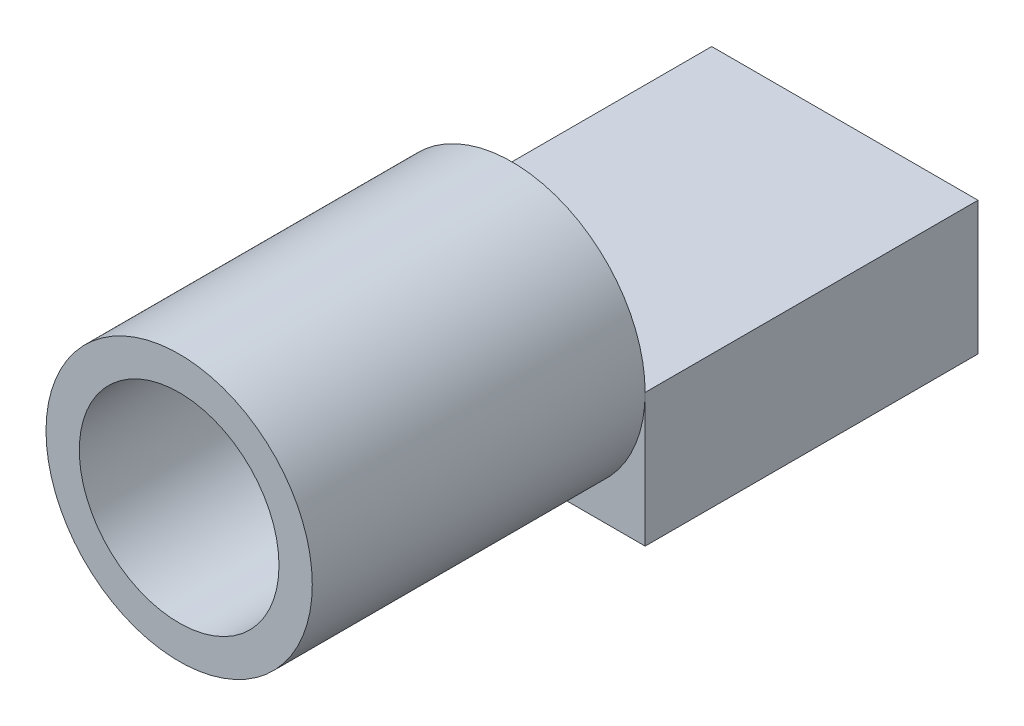
ISO-10303-21;
HEADER;
FILE_DESCRIPTION(('STEP AP214'),'2;1');
FILE_NAME('part.step','',(''),(''),'','','');
FILE_SCHEMA(('AUTOMOTIVE_DESIGN { 1 0 10303 214 1 1 1 1 }'));
ENDSEC;
DATA;
#1=APPLICATION_CONTEXT('core data for automotive mechanical design processes');
#2=APPLICATION_PROTOCOL_DEFINITION('international standard','automotive_design',2000,#1);
#3=PRODUCT_CONTEXT('',#1,'mechanical');
#4=PRODUCT('Part','Part','',(#3));
#5=PRODUCT_RELATED_PRODUCT_CATEGORY('part','',(#4));
#6=PRODUCT_DEFINITION_FORMATION('','',#4);
#7=PRODUCT_DEFINITION_CONTEXT('part definition',#1,'design');
#8=PRODUCT_DEFINITION('design','',#6,#7);
#9=PRODUCT_DEFINITION_SHAPE('','',#8);
#10=(LENGTH_UNIT() NAMED_UNIT(*) SI_UNIT(.MILLI.,.METRE.));
#11=(NAMED_UNIT(*) PLANE_ANGLE_UNIT() SI_UNIT($,.RADIAN.));
#12=(NAMED_UNIT(*) SI_UNIT($,.STERADIAN.) SOLID_ANGLE_UNIT());
#13=UNCERTAINTY_MEASURE_WITH_UNIT(LENGTH_MEASURE(1.E-05),#10,'distance_accuracy_value','');
#14=(GEOMETRIC_REPRESENTATION_CONTEXT(3) GLOBAL_UNCERTAINTY_ASSIGNED_CONTEXT((#13)) GLOBAL_UNIT_ASSIGNED_CONTEXT((#10,
#11,#12)) REPRESENTATION_CONTEXT('',''));
#15=CARTESIAN_POINT('',(0.,0.,0.));
#16=DIRECTION('',(0.,0.,1.));
#17=DIRECTION('',(1.,0.,0.));
#18=AXIS2_PLACEMENT_3D('',#15,#16,#17);
#19=CARTESIAN_POINT('',(0.,0.,0.));
#20=DIRECTION('',(0.,0.,1.));
#21=DIRECTION('',(1.,0.,0.));
#22=AXIS2_PLACEMENT_3D('',#19,#20,#21);
#23=PLANE('',#22);
#24=DIRECTION('',(1.,0.,0.));
#25=VECTOR('',#24,1.);
#26=CARTESIAN_POINT('',(4.,0.,0.));
#27=LINE('',#26,#25);
#28=CARTESIAN_POINT('',(-4.,0.,0.));
#29=VERTEX_POINT('',#28);
#30=CARTESIAN_POINT('',(-3.,0.,0.));
#31=VERTEX_POINT('',#30);
#32=EDGE_CURVE('E44',#29,#31,#27,.T.);
#33=ORIENTED_EDGE('',*,*,#32,.F.);
#34=CARTESIAN_POINT('',(0.,0.,0.));
#35=DIRECTION('',(0.,0.,1.));
#36=DIRECTION('',(1.,0.,0.));
#37=AXIS2_PLACEMENT_3D('',#34,#35,#36);
#38=CIRCLE('',#37,4.);
#39=CARTESIAN_POINT('',(4.,0.,0.));
#40=VERTEX_POINT('',#39);
#41=EDGE_CURVE('E37',#40,#29,#38,.T.);
#42=ORIENTED_EDGE('',*,*,#41,.F.);
#43=CARTESIAN_POINT('',(3.,0.,0.));
#44=VERTEX_POINT('',#43);
#45=EDGE_CURVE('E11',#44,#40,#27,.T.);
#46=ORIENTED_EDGE('',*,*,#45,.F.);
#47=CARTESIAN_POINT('',(0.,0.,0.));
#48=DIRECTION('',(0.,0.,1.));
#49=DIRECTION('',(1.,0.,0.));
#50=AXIS2_PLACEMENT_3D('',#47,#48,#49);
#51=CIRCLE('',#50,3.);
#52=EDGE_CURVE('E111',#44,#31,#51,.T.);
#53=ORIENTED_EDGE('',*,*,#52,.T.);
#54=EDGE_LOOP('',(#33,#42,#46,#53));
#55=FACE_BOUND('',#54,.T.);
#56=ADVANCED_FACE('F33',(#55),#23,.F.);
#57=CARTESIAN_POINT('',(0.,0.,10.));
#58=DIRECTION('',(0.,0.,1.));
#59=DIRECTION('',(1.,0.,0.));
#60=AXIS2_PLACEMENT_3D('',#57,#58,#59);
#61=PLANE('',#60);
#62=CARTESIAN_POINT('',(0.,0.,10.));
#63=DIRECTION('',(0.,0.,1.));
#64=DIRECTION('',(1.,0.,0.));
#65=AXIS2_PLACEMENT_3D('',#62,#63,#64);
#66=CIRCLE('',#65,4.);
#67=CARTESIAN_POINT('',(4.,0.,10.));
#68=VERTEX_POINT('',#67);
#69=EDGE_CURVE('E42',#68,#68,#66,.T.);
#70=ORIENTED_EDGE('',*,*,#69,.T.);
#71=EDGE_LOOP('',(#70));
#72=FACE_BOUND('',#71,.T.);
#73=CARTESIAN_POINT('',(0.,0.,10.));
#74=DIRECTION('',(0.,0.,1.));
#75=DIRECTION('',(1.,0.,0.));
#76=AXIS2_PLACEMENT_3D('',#73,#74,#75);
#77=CIRCLE('',#76,3.);
#78=CARTESIAN_POINT('',(3.,0.,10.));
#79=VERTEX_POINT('',#78);
#80=EDGE_CURVE('E117',#79,#79,#77,.T.);
#81=ORIENTED_EDGE('',*,*,#80,.F.);
#82=EDGE_LOOP('',(#81));
#83=FACE_BOUND('',#82,.T.);
#84=ADVANCED_FACE('F170',(#72,#83),#61,.T.);
#85=CARTESIAN_POINT('',(0.,0.,10.));
#86=DIRECTION('',(0.,0.,-1.));
#87=DIRECTION('',(-1.,0.,0.));
#88=AXIS2_PLACEMENT_3D('',#85,#86,#87);
#89=CYLINDRICAL_SURFACE('',#88,4.);
#90=ORIENTED_EDGE('',*,*,#69,.F.);
#91=EDGE_LOOP('',(#90));
#92=FACE_BOUND('',#91,.T.);
#93=ORIENTED_EDGE('',*,*,#41,.T.);
#94=CARTESIAN_POINT('',(0.,-4.,0.));
#95=VERTEX_POINT('',#94);
#96=EDGE_CURVE('E124',#29,#95,#38,.T.);
#97=ORIENTED_EDGE('',*,*,#96,.T.);
#98=EDGE_CURVE('E119',#95,#40,#38,.T.);
#99=ORIENTED_EDGE('',*,*,#98,.T.);
#100=EDGE_LOOP('',(#93,#97,#99));
#101=FACE_BOUND('',#100,.T.);
#102=ADVANCED_FACE('F35',(#92,#101),#89,.T.);
#103=CARTESIAN_POINT('',(0.,0.,10.));
#104=DIRECTION('',(0.,0.,-1.));
#105=DIRECTION('',(-1.,0.,0.));
#106=AXIS2_PLACEMENT_3D('',#103,#104,#105);
#107=CYLINDRICAL_SURFACE('',#106,3.);
#108=ORIENTED_EDGE('',*,*,#80,.T.);
#109=EDGE_LOOP('',(#108));
#110=FACE_BOUND('',#109,.T.);
#111=ORIENTED_EDGE('',*,*,#52,.F.);
#112=EDGE_CURVE('E51',#31,#44,#51,.T.);
#113=ORIENTED_EDGE('',*,*,#112,.F.);
#114=EDGE_LOOP('',(#111,#113));
#115=FACE_BOUND('',#114,.T.);
#116=ADVANCED_FACE('F156',(#110,#115),#107,.F.);
#117=CARTESIAN_POINT('',(0.,0.,0.));
#118=DIRECTION('',(0.,0.,1.));
#119=DIRECTION('',(1.,0.,0.));
#120=AXIS2_PLACEMENT_3D('',#117,#118,#119);
#121=PLANE('',#120);
#122=ORIENTED_EDGE('',*,*,#96,.F.);
#123=DIRECTION('',(0.,1.,0.));
#124=VECTOR('',#123,1.);
#125=CARTESIAN_POINT('',(-4.,0.,0.));
#126=LINE('',#125,#124);
#127=CARTESIAN_POINT('',(-4.,-4.,0.));
#128=VERTEX_POINT('',#127);
#129=EDGE_CURVE('E146',#128,#29,#126,.T.);
#130=ORIENTED_EDGE('',*,*,#129,.F.);
#131=DIRECTION('',(-1.,0.,0.));
#132=VECTOR('',#131,1.);
#133=CARTESIAN_POINT('',(-4.,-4.,0.));
#134=LINE('',#133,#132);
#135=EDGE_CURVE('E140',#95,#128,#134,.T.);
#136=ORIENTED_EDGE('',*,*,#135,.F.);
#137=EDGE_LOOP('',(#122,#130,#136));
#138=FACE_BOUND('',#137,.T.);
#139=ADVANCED_FACE('F154',(#138),#121,.T.);
#140=ORIENTED_EDGE('',*,*,#98,.F.);
#141=CARTESIAN_POINT('',(4.,-4.,0.));
#142=VERTEX_POINT('',#141);
#143=EDGE_CURVE('E139',#142,#95,#134,.T.);
#144=ORIENTED_EDGE('',*,*,#143,.F.);
#145=DIRECTION('',(0.,-1.,0.));
#146=VECTOR('',#145,1.);
#147=CARTESIAN_POINT('',(4.,-4.,0.));
#148=LINE('',#147,#146);
#149=EDGE_CURVE('E109',#40,#142,#148,.T.);
#150=ORIENTED_EDGE('',*,*,#149,.F.);
#151=EDGE_LOOP('',(#140,#144,#150));
#152=FACE_BOUND('',#151,.T.);
#153=ADVANCED_FACE('F138',(#152),#121,.T.);
#154=CARTESIAN_POINT('',(4.,-4.,-10.));
#155=DIRECTION('',(-1.,0.,0.));
#156=DIRECTION('',(0.,0.,1.));
#157=AXIS2_PLACEMENT_3D('',#154,#155,#156);
#158=PLANE('',#157);
#159=ORIENTED_EDGE('',*,*,#149,.T.);
#160=DIRECTION('',(0.,0.,1.));
#161=VECTOR('',#160,1.);
#162=CARTESIAN_POINT('',(4.,-4.,-10.));
#163=LINE('',#162,#161);
#164=CARTESIAN_POINT('',(4.,-4.,-10.));
#165=VERTEX_POINT('',#164);
#166=EDGE_CURVE('E90',#165,#142,#163,.T.);
#167=ORIENTED_EDGE('',*,*,#166,.F.);
#168=DIRECTION('',(0.,-1.,0.));
#169=VECTOR('',#168,1.);
#170=CARTESIAN_POINT('',(4.,-4.,-10.));
#171=LINE('',#170,#169);
#172=CARTESIAN_POINT('',(4.,0.,-10.));
#173=VERTEX_POINT('',#172);
#174=EDGE_CURVE('E97',#173,#165,#171,.T.);
#175=ORIENTED_EDGE('',*,*,#174,.F.);
#176=DIRECTION('',(0.,0.,1.));
#177=VECTOR('',#176,1.);
#178=CARTESIAN_POINT('',(4.,0.,-10.));
#179=LINE('',#178,#177);
#180=EDGE_CURVE('E135',#173,#40,#179,.T.);
#181=ORIENTED_EDGE('',*,*,#180,.T.);
#182=EDGE_LOOP('',(#159,#167,#175,#181));
#183=FACE_BOUND('',#182,.T.);
#184=ADVANCED_FACE('F107',(#183),#158,.F.);
#185=CARTESIAN_POINT('',(-4.,-4.,-10.));
#186=DIRECTION('',(0.,1.,0.));
#187=DIRECTION('',(0.,0.,1.));
#188=AXIS2_PLACEMENT_3D('',#185,#186,#187);
#189=PLANE('',#188);
#190=ORIENTED_EDGE('',*,*,#143,.T.);
#191=ORIENTED_EDGE('',*,*,#135,.T.);
#192=DIRECTION('',(0.,0.,1.));
#193=VECTOR('',#192,1.);
#194=CARTESIAN_POINT('',(-4.,-4.,-10.));
#195=LINE('',#194,#193);
#196=CARTESIAN_POINT('',(-4.,-4.,-10.));
#197=VERTEX_POINT('',#196);
#198=EDGE_CURVE('E93',#197,#128,#195,.T.);
#199=ORIENTED_EDGE('',*,*,#198,.F.);
#200=DIRECTION('',(-1.,0.,0.));
#201=VECTOR('',#200,1.);
#202=CARTESIAN_POINT('',(-4.,-4.,-10.));
#203=LINE('',#202,#201);
#204=EDGE_CURVE('E85',#165,#197,#203,.T.);
#205=ORIENTED_EDGE('',*,*,#204,.F.);
#206=ORIENTED_EDGE('',*,*,#166,.T.);
#207=EDGE_LOOP('',(#190,#191,#199,#205,#206));
#208=FACE_BOUND('',#207,.T.);
#209=ADVANCED_FACE('F88',(#208),#189,.F.);
#210=CARTESIAN_POINT('',(-4.,0.,-10.));
#211=DIRECTION('',(1.,0.,0.));
#212=DIRECTION('',(0.,0.,-1.));
#213=AXIS2_PLACEMENT_3D('',#210,#211,#212);
#214=PLANE('',#213);
#215=ORIENTED_EDGE('',*,*,#129,.T.);
#216=DIRECTION('',(0.,0.,1.));
#217=VECTOR('',#216,1.);
#218=CARTESIAN_POINT('',(-4.,0.,-10.));
#219=LINE('',#218,#217);
#220=CARTESIAN_POINT('',(-4.,0.,-10.));
#221=VERTEX_POINT('',#220);
#222=EDGE_CURVE('E113',#221,#29,#219,.T.);
#223=ORIENTED_EDGE('',*,*,#222,.F.);
#224=DIRECTION('',(0.,1.,0.));
#225=VECTOR('',#224,1.);
#226=CARTESIAN_POINT('',(-4.,0.,-10.));
#227=LINE('',#226,#225);
#228=EDGE_CURVE('E96',#197,#221,#227,.T.);
#229=ORIENTED_EDGE('',*,*,#228,.F.);
#230=ORIENTED_EDGE('',*,*,#198,.T.);
#231=EDGE_LOOP('',(#215,#223,#229,#230));
#232=FACE_BOUND('',#231,.T.);
#233=ADVANCED_FACE('F151',(#232),#214,.F.);
#234=CARTESIAN_POINT('',(4.,0.,-10.));
#235=DIRECTION('',(0.,-1.,0.));
#236=DIRECTION('',(0.,0.,-1.));
#237=AXIS2_PLACEMENT_3D('',#234,#235,#236);
#238=PLANE('',#237);
#239=ORIENTED_EDGE('',*,*,#32,.T.);
#240=EDGE_CURVE('E45',#31,#44,#27,.T.);
#241=ORIENTED_EDGE('',*,*,#240,.T.);
#242=ORIENTED_EDGE('',*,*,#45,.T.);
#243=ORIENTED_EDGE('',*,*,#180,.F.);
#244=DIRECTION('',(1.,0.,0.));
#245=VECTOR('',#244,1.);
#246=CARTESIAN_POINT('',(4.,0.,-10.));
#247=LINE('',#246,#245);
#248=EDGE_CURVE('E102',#221,#173,#247,.T.);
#249=ORIENTED_EDGE('',*,*,#248,.F.);
#250=ORIENTED_EDGE('',*,*,#222,.T.);
#251=EDGE_LOOP('',(#239,#241,#242,#243,#249,#250));
#252=FACE_BOUND('',#251,.T.);
#253=ADVANCED_FACE('F134',(#252),#238,.F.);
#254=CARTESIAN_POINT('',(0.,0.,-10.));
#255=DIRECTION('',(0.,0.,1.));
#256=DIRECTION('',(1.,0.,0.));
#257=AXIS2_PLACEMENT_3D('',#254,#255,#256);
#258=PLANE('',#257);
#259=ORIENTED_EDGE('',*,*,#174,.T.);
#260=ORIENTED_EDGE('',*,*,#204,.T.);
#261=ORIENTED_EDGE('',*,*,#228,.T.);
#262=ORIENTED_EDGE('',*,*,#248,.T.);
#263=EDGE_LOOP('',(#259,#260,#261,#262));
#264=FACE_BOUND('',#263,.T.);
#265=ADVANCED_FACE('F100',(#264),#258,.F.);
#266=ORIENTED_EDGE('',*,*,#240,.F.);
#267=ORIENTED_EDGE('',*,*,#112,.T.);
#268=EDGE_LOOP('',(#266,#267));
#269=FACE_BOUND('',#268,.T.);
#270=ADVANCED_FACE('F158',(#269),#121,.T.);
#271=CLOSED_SHELL('',(#56,#84,#102,#116,#139,#153,#184,#209,#233,#253,#265,#270));
#272=MANIFOLD_SOLID_BREP('B2',#271);
#273=ADVANCED_BREP_SHAPE_REPRESENTATION('',(#18,#272),#14);
#274=SHAPE_DEFINITION_REPRESENTATION(#9,#273);
ENDSEC;
END-ISO-10303-21;
